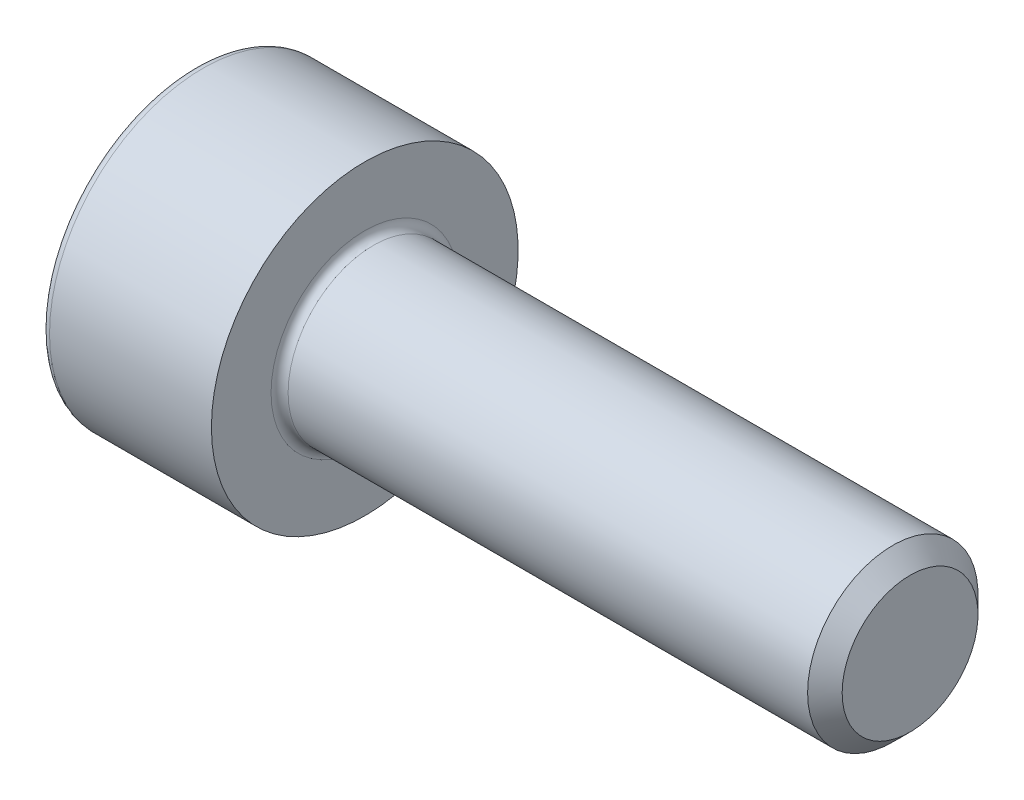
ISO-10303-21;
HEADER;
FILE_DESCRIPTION(('STEP AP214'),'2;1');
FILE_NAME('part.step','',(''),(''),'','','');
FILE_SCHEMA(('AUTOMOTIVE_DESIGN { 1 0 10303 214 1 1 1 1 }'));
ENDSEC;
DATA;
#1=APPLICATION_CONTEXT('core data for automotive mechanical design processes');
#2=APPLICATION_PROTOCOL_DEFINITION('international standard','automotive_design',2000,#1);
#3=PRODUCT_CONTEXT('',#1,'mechanical');
#4=PRODUCT('Part','Part','',(#3));
#5=PRODUCT_RELATED_PRODUCT_CATEGORY('part','',(#4));
#6=PRODUCT_DEFINITION_FORMATION('','',#4);
#7=PRODUCT_DEFINITION_CONTEXT('part definition',#1,'design');
#8=PRODUCT_DEFINITION('design','',#6,#7);
#9=PRODUCT_DEFINITION_SHAPE('','',#8);
#10=(LENGTH_UNIT() NAMED_UNIT(*) SI_UNIT(.MILLI.,.METRE.));
#11=(NAMED_UNIT(*) PLANE_ANGLE_UNIT() SI_UNIT($,.RADIAN.));
#12=(NAMED_UNIT(*) SI_UNIT($,.STERADIAN.) SOLID_ANGLE_UNIT());
#13=UNCERTAINTY_MEASURE_WITH_UNIT(LENGTH_MEASURE(1.E-05),#10,'distance_accuracy_value','');
#14=(GEOMETRIC_REPRESENTATION_CONTEXT(3) GLOBAL_UNCERTAINTY_ASSIGNED_CONTEXT((#13)) GLOBAL_UNIT_ASSIGNED_CONTEXT((#10,
#11,#12)) REPRESENTATION_CONTEXT('',''));
#15=CARTESIAN_POINT('',(0.,0.,0.));
#16=DIRECTION('',(0.,0.,1.));
#17=DIRECTION('',(1.,0.,0.));
#18=AXIS2_PLACEMENT_3D('',#15,#16,#17);
#19=CARTESIAN_POINT('',(8.,0.,0.));
#20=DIRECTION('',(-1.,0.,0.));
#21=DIRECTION('',(0.,0.,1.));
#22=AXIS2_PLACEMENT_3D('',#19,#20,#21);
#23=CONICAL_SURFACE('',#22,0.996499999993503,0.785398163397448);
#24=CARTESIAN_POINT('',(7.7464999999935,0.,0.));
#25=DIRECTION('',(-1.,0.,0.));
#26=DIRECTION('',(0.,0.,1.));
#27=AXIS2_PLACEMENT_3D('',#24,#25,#26);
#28=CIRCLE('',#27,1.25);
#29=CARTESIAN_POINT('',(7.7464999999935,0.,1.25));
#30=VERTEX_POINT('',#29);
#31=EDGE_CURVE('E11',#30,#30,#28,.T.);
#32=ORIENTED_EDGE('',*,*,#31,.F.);
#33=EDGE_LOOP('',(#32));
#34=FACE_BOUND('',#33,.T.);
#35=CARTESIAN_POINT('',(8.,0.,0.));
#36=DIRECTION('',(-1.,0.,0.));
#37=DIRECTION('',(0.,0.,1.));
#38=AXIS2_PLACEMENT_3D('',#35,#36,#37);
#39=CIRCLE('',#38,0.996499999993503);
#40=CARTESIAN_POINT('',(8.,0.,0.996499999993503));
#41=VERTEX_POINT('',#40);
#42=EDGE_CURVE('E134',#41,#41,#39,.T.);
#43=ORIENTED_EDGE('',*,*,#42,.T.);
#44=EDGE_LOOP('',(#43));
#45=FACE_BOUND('',#44,.T.);
#46=ADVANCED_FACE('F33',(#34,#45),#23,.T.);
#47=CARTESIAN_POINT('',(-2.5,0.,0.));
#48=DIRECTION('',(-1.,0.,0.));
#49=DIRECTION('',(0.,0.,1.));
#50=AXIS2_PLACEMENT_3D('',#47,#48,#49);
#51=CYLINDRICAL_SURFACE('',#50,1.25);
#52=CARTESIAN_POINT('',(0.125,0.,0.));
#53=DIRECTION('',(-1.,0.,0.));
#54=DIRECTION('',(0.,0.,1.));
#55=AXIS2_PLACEMENT_3D('',#52,#53,#54);
#56=CIRCLE('',#55,1.25);
#57=CARTESIAN_POINT('',(0.125,0.,1.25));
#58=VERTEX_POINT('',#57);
#59=EDGE_CURVE('E40',#58,#58,#56,.T.);
#60=ORIENTED_EDGE('',*,*,#59,.F.);
#61=EDGE_LOOP('',(#60));
#62=FACE_BOUND('',#61,.T.);
#63=ORIENTED_EDGE('',*,*,#31,.T.);
#64=EDGE_LOOP('',(#63));
#65=FACE_BOUND('',#64,.T.);
#66=ADVANCED_FACE('F158',(#62,#65),#51,.T.);
#67=CARTESIAN_POINT('',(0.125,0.,0.));
#68=DIRECTION('',(-1.,0.,0.));
#69=DIRECTION('',(0.,0.,1.));
#70=AXIS2_PLACEMENT_3D('',#67,#68,#69);
#71=TOROIDAL_SURFACE('',#70,1.375,0.125);
#72=CARTESIAN_POINT('',(0.,0.,0.));
#73=DIRECTION('',(-1.,0.,0.));
#74=DIRECTION('',(0.,0.,1.));
#75=AXIS2_PLACEMENT_3D('',#72,#73,#74);
#76=CIRCLE('',#75,1.375);
#77=CARTESIAN_POINT('',(0.,0.,1.375));
#78=VERTEX_POINT('',#77);
#79=EDGE_CURVE('E151',#78,#78,#76,.T.);
#80=ORIENTED_EDGE('',*,*,#79,.F.);
#81=EDGE_LOOP('',(#80));
#82=FACE_BOUND('',#81,.T.);
#83=ORIENTED_EDGE('',*,*,#59,.T.);
#84=EDGE_LOOP('',(#83));
#85=FACE_BOUND('',#84,.T.);
#86=ADVANCED_FACE('F156',(#82,#85),#71,.F.);
#87=CARTESIAN_POINT('',(0.,1.375,0.));
#88=DIRECTION('',(-1.,0.,0.));
#89=DIRECTION('',(0.,0.,1.));
#90=AXIS2_PLACEMENT_3D('',#87,#88,#89);
#91=PLANE('',#90);
#92=CARTESIAN_POINT('',(0.,0.,0.));
#93=DIRECTION('',(-1.,0.,0.));
#94=DIRECTION('',(0.,0.,1.));
#95=AXIS2_PLACEMENT_3D('',#92,#93,#94);
#96=CIRCLE('',#95,2.25);
#97=CARTESIAN_POINT('',(0.,0.,2.25));
#98=VERTEX_POINT('',#97);
#99=EDGE_CURVE('E148',#98,#98,#96,.T.);
#100=ORIENTED_EDGE('',*,*,#99,.F.);
#101=EDGE_LOOP('',(#100));
#102=FACE_BOUND('',#101,.T.);
#103=ORIENTED_EDGE('',*,*,#79,.T.);
#104=EDGE_LOOP('',(#103));
#105=FACE_BOUND('',#104,.T.);
#106=ADVANCED_FACE('F189',(#102,#105),#91,.F.);
#107=CARTESIAN_POINT('',(-2.5,0.,0.));
#108=DIRECTION('',(-1.,0.,0.));
#109=DIRECTION('',(0.,0.,1.));
#110=AXIS2_PLACEMENT_3D('',#107,#108,#109);
#111=CYLINDRICAL_SURFACE('',#110,2.25);
#112=CARTESIAN_POINT('',(-2.375,0.,0.));
#113=DIRECTION('',(-1.,0.,0.));
#114=DIRECTION('',(0.,0.,1.));
#115=AXIS2_PLACEMENT_3D('',#112,#113,#114);
#116=CIRCLE('',#115,2.25);
#117=CARTESIAN_POINT('',(-2.375,0.,2.25));
#118=VERTEX_POINT('',#117);
#119=EDGE_CURVE('E145',#118,#118,#116,.T.);
#120=ORIENTED_EDGE('',*,*,#119,.F.);
#121=EDGE_LOOP('',(#120));
#122=FACE_BOUND('',#121,.T.);
#123=ORIENTED_EDGE('',*,*,#99,.T.);
#124=EDGE_LOOP('',(#123));
#125=FACE_BOUND('',#124,.T.);
#126=ADVANCED_FACE('F185',(#122,#125),#111,.T.);
#127=CARTESIAN_POINT('',(-2.375,0.,0.));
#128=DIRECTION('',(-1.,0.,0.));
#129=DIRECTION('',(0.,0.,1.));
#130=AXIS2_PLACEMENT_3D('',#127,#128,#129);
#131=TOROIDAL_SURFACE('',#130,2.125,0.125);
#132=CARTESIAN_POINT('',(-2.5,0.,0.));
#133=DIRECTION('',(-1.,0.,0.));
#134=DIRECTION('',(0.,0.,1.));
#135=AXIS2_PLACEMENT_3D('',#132,#133,#134);
#136=CIRCLE('',#135,2.125);
#137=CARTESIAN_POINT('',(-2.5,0.,2.125));
#138=VERTEX_POINT('',#137);
#139=EDGE_CURVE('E142',#138,#138,#136,.T.);
#140=ORIENTED_EDGE('',*,*,#139,.F.);
#141=EDGE_LOOP('',(#140));
#142=FACE_BOUND('',#141,.T.);
#143=ORIENTED_EDGE('',*,*,#119,.T.);
#144=EDGE_LOOP('',(#143));
#145=FACE_BOUND('',#144,.T.);
#146=ADVANCED_FACE('F178',(#142,#145),#131,.T.);
#147=CARTESIAN_POINT('',(-2.5,2.125,0.));
#148=DIRECTION('',(1.,0.,0.));
#149=DIRECTION('',(0.,0.,-1.));
#150=AXIS2_PLACEMENT_3D('',#147,#148,#149);
#151=PLANE('',#150);
#152=DIRECTION('',(0.,0.5,-0.866025403784438));
#153=VECTOR('',#152,1.);
#154=CARTESIAN_POINT('',(-2.5,0.591784025919366,1.025));
#155=LINE('',#154,#153);
#156=CARTESIAN_POINT('',(-2.5,0.591784025919366,1.025));
#157=VERTEX_POINT('',#156);
#158=CARTESIAN_POINT('',(-2.5,1.18356805183873,0.));
#159=VERTEX_POINT('',#158);
#160=EDGE_CURVE('E121',#157,#159,#155,.T.);
#161=ORIENTED_EDGE('',*,*,#160,.F.);
#162=DIRECTION('',(0.,1.,0.));
#163=VECTOR('',#162,1.);
#164=CARTESIAN_POINT('',(-2.5,-0.591784025919367,1.025));
#165=LINE('',#164,#163);
#166=CARTESIAN_POINT('',(-2.5,-0.591784025919367,1.025));
#167=VERTEX_POINT('',#166);
#168=EDGE_CURVE('E47',#167,#157,#165,.T.);
#169=ORIENTED_EDGE('',*,*,#168,.F.);
#170=DIRECTION('',(0.,0.5,0.866025403784439));
#171=VECTOR('',#170,1.);
#172=CARTESIAN_POINT('',(-2.5,-1.18356805183873,0.));
#173=LINE('',#172,#171);
#174=CARTESIAN_POINT('',(-2.5,-1.18356805183873,0.));
#175=VERTEX_POINT('',#174);
#176=EDGE_CURVE('E130',#175,#167,#173,.T.);
#177=ORIENTED_EDGE('',*,*,#176,.F.);
#178=DIRECTION('',(0.,-0.5,0.866025403784438));
#179=VECTOR('',#178,1.);
#180=CARTESIAN_POINT('',(-2.5,-0.591784025919366,-1.025));
#181=LINE('',#180,#179);
#182=CARTESIAN_POINT('',(-2.5,-0.591784025919366,-1.025));
#183=VERTEX_POINT('',#182);
#184=EDGE_CURVE('E128',#183,#175,#181,.T.);
#185=ORIENTED_EDGE('',*,*,#184,.F.);
#186=DIRECTION('',(0.,-1.,0.));
#187=VECTOR('',#186,1.);
#188=CARTESIAN_POINT('',(-2.5,0.591784025919367,-1.025));
#189=LINE('',#188,#187);
#190=CARTESIAN_POINT('',(-2.5,0.591784025919367,-1.025));
#191=VERTEX_POINT('',#190);
#192=EDGE_CURVE('E95',#191,#183,#189,.T.);
#193=ORIENTED_EDGE('',*,*,#192,.F.);
#194=DIRECTION('',(0.,-0.5,-0.866025403784439));
#195=VECTOR('',#194,1.);
#196=CARTESIAN_POINT('',(-2.5,1.18356805183873,0.));
#197=LINE('',#196,#195);
#198=EDGE_CURVE('E124',#159,#191,#197,.T.);
#199=ORIENTED_EDGE('',*,*,#198,.F.);
#200=EDGE_LOOP('',(#161,#169,#177,#185,#193,#199));
#201=FACE_BOUND('',#200,.T.);
#202=ORIENTED_EDGE('',*,*,#139,.T.);
#203=EDGE_LOOP('',(#202));
#204=FACE_BOUND('',#203,.T.);
#205=ADVANCED_FACE('F170',(#201,#204),#151,.F.);
#206=CARTESIAN_POINT('',(8.,0.996499999993503,0.));
#207=DIRECTION('',(-1.,0.,0.));
#208=DIRECTION('',(0.,0.,1.));
#209=AXIS2_PLACEMENT_3D('',#206,#207,#208);
#210=PLANE('',#209);
#211=ORIENTED_EDGE('',*,*,#42,.F.);
#212=EDGE_LOOP('',(#211));
#213=FACE_BOUND('',#212,.T.);
#214=ADVANCED_FACE('F167',(#213),#210,.F.);
#215=CARTESIAN_POINT('',(-1.4,-0.591784025919367,1.025));
#216=DIRECTION('',(0.,0.,1.));
#217=DIRECTION('',(1.,0.,0.));
#218=AXIS2_PLACEMENT_3D('',#215,#216,#217);
#219=PLANE('',#218);
#220=ORIENTED_EDGE('',*,*,#168,.T.);
#221=DIRECTION('',(-1.,0.,0.));
#222=VECTOR('',#221,1.);
#223=CARTESIAN_POINT('',(-1.4,0.591784025919366,1.025));
#224=LINE('',#223,#222);
#225=CARTESIAN_POINT('',(-1.4,0.591784025919366,1.025));
#226=VERTEX_POINT('',#225);
#227=EDGE_CURVE('E77',#226,#157,#224,.T.);
#228=ORIENTED_EDGE('',*,*,#227,.F.);
#229=DIRECTION('',(0.,1.,0.));
#230=VECTOR('',#229,1.);
#231=CARTESIAN_POINT('',(-1.4,-0.591784025919367,1.025));
#232=LINE('',#231,#230);
#233=CARTESIAN_POINT('',(-1.4,-0.591784025919367,1.025));
#234=VERTEX_POINT('',#233);
#235=EDGE_CURVE('E132',#234,#226,#232,.T.);
#236=ORIENTED_EDGE('',*,*,#235,.F.);
#237=DIRECTION('',(-1.,0.,0.));
#238=VECTOR('',#237,1.);
#239=CARTESIAN_POINT('',(-1.4,-0.591784025919367,1.025));
#240=LINE('',#239,#238);
#241=EDGE_CURVE('E55',#234,#167,#240,.T.);
#242=ORIENTED_EDGE('',*,*,#241,.T.);
#243=EDGE_LOOP('',(#220,#228,#236,#242));
#244=FACE_BOUND('',#243,.T.);
#245=ADVANCED_FACE('F169',(#244),#219,.F.);
#246=CARTESIAN_POINT('',(-1.4,-1.18356805183873,0.));
#247=DIRECTION('',(0.,-0.866025403784439,0.5));
#248=DIRECTION('',(0.,-0.5,-0.866025403784439));
#249=AXIS2_PLACEMENT_3D('',#246,#247,#248);
#250=PLANE('',#249);
#251=ORIENTED_EDGE('',*,*,#176,.T.);
#252=ORIENTED_EDGE('',*,*,#241,.F.);
#253=DIRECTION('',(0.,0.5,0.866025403784439));
#254=VECTOR('',#253,1.);
#255=CARTESIAN_POINT('',(-1.4,-1.18356805183873,0.));
#256=LINE('',#255,#254);
#257=CARTESIAN_POINT('',(-1.4,-1.18356805183873,0.));
#258=VERTEX_POINT('',#257);
#259=EDGE_CURVE('E107',#258,#234,#256,.T.);
#260=ORIENTED_EDGE('',*,*,#259,.F.);
#261=DIRECTION('',(-1.,0.,0.));
#262=VECTOR('',#261,1.);
#263=CARTESIAN_POINT('',(-1.4,-1.18356805183873,0.));
#264=LINE('',#263,#262);
#265=EDGE_CURVE('E99',#258,#175,#264,.T.);
#266=ORIENTED_EDGE('',*,*,#265,.T.);
#267=EDGE_LOOP('',(#251,#252,#260,#266));
#268=FACE_BOUND('',#267,.T.);
#269=ADVANCED_FACE('F176',(#268),#250,.F.);
#270=CARTESIAN_POINT('',(-1.4,-0.591784025919366,-1.025));
#271=DIRECTION('',(0.,-0.866025403784439,-0.5));
#272=DIRECTION('',(0.,0.5,-0.866025403784438));
#273=AXIS2_PLACEMENT_3D('',#270,#271,#272);
#274=PLANE('',#273);
#275=ORIENTED_EDGE('',*,*,#184,.T.);
#276=ORIENTED_EDGE('',*,*,#265,.F.);
#277=DIRECTION('',(0.,-0.5,0.866025403784438));
#278=VECTOR('',#277,1.);
#279=CARTESIAN_POINT('',(-1.4,-0.591784025919366,-1.025));
#280=LINE('',#279,#278);
#281=CARTESIAN_POINT('',(-1.4,-0.591784025919366,-1.025));
#282=VERTEX_POINT('',#281);
#283=EDGE_CURVE('E103',#282,#258,#280,.T.);
#284=ORIENTED_EDGE('',*,*,#283,.F.);
#285=DIRECTION('',(-1.,0.,0.));
#286=VECTOR('',#285,1.);
#287=CARTESIAN_POINT('',(-1.4,-0.591784025919366,-1.025));
#288=LINE('',#287,#286);
#289=EDGE_CURVE('E88',#282,#183,#288,.T.);
#290=ORIENTED_EDGE('',*,*,#289,.T.);
#291=EDGE_LOOP('',(#275,#276,#284,#290));
#292=FACE_BOUND('',#291,.T.);
#293=ADVANCED_FACE('F104',(#292),#274,.F.);
#294=CARTESIAN_POINT('',(-1.4,0.591784025919367,-1.025));
#295=DIRECTION('',(0.,0.,-1.));
#296=DIRECTION('',(-1.,0.,0.));
#297=AXIS2_PLACEMENT_3D('',#294,#295,#296);
#298=PLANE('',#297);
#299=ORIENTED_EDGE('',*,*,#192,.T.);
#300=ORIENTED_EDGE('',*,*,#289,.F.);
#301=DIRECTION('',(0.,-1.,0.));
#302=VECTOR('',#301,1.);
#303=CARTESIAN_POINT('',(-1.4,0.591784025919367,-1.025));
#304=LINE('',#303,#302);
#305=CARTESIAN_POINT('',(-1.4,0.591784025919367,-1.025));
#306=VERTEX_POINT('',#305);
#307=EDGE_CURVE('E92',#306,#282,#304,.T.);
#308=ORIENTED_EDGE('',*,*,#307,.F.);
#309=DIRECTION('',(-1.,0.,0.));
#310=VECTOR('',#309,1.);
#311=CARTESIAN_POINT('',(-1.4,0.591784025919367,-1.025));
#312=LINE('',#311,#310);
#313=EDGE_CURVE('E100',#306,#191,#312,.T.);
#314=ORIENTED_EDGE('',*,*,#313,.T.);
#315=EDGE_LOOP('',(#299,#300,#308,#314));
#316=FACE_BOUND('',#315,.T.);
#317=ADVANCED_FACE('F90',(#316),#298,.F.);
#318=CARTESIAN_POINT('',(-1.4,1.18356805183873,0.));
#319=DIRECTION('',(0.,0.866025403784439,-0.5));
#320=DIRECTION('',(0.,0.5,0.866025403784439));
#321=AXIS2_PLACEMENT_3D('',#318,#319,#320);
#322=PLANE('',#321);
#323=ORIENTED_EDGE('',*,*,#198,.T.);
#324=ORIENTED_EDGE('',*,*,#313,.F.);
#325=DIRECTION('',(0.,-0.5,-0.866025403784439));
#326=VECTOR('',#325,1.);
#327=CARTESIAN_POINT('',(-1.4,1.18356805183873,0.));
#328=LINE('',#327,#326);
#329=CARTESIAN_POINT('',(-1.4,1.18356805183873,0.));
#330=VERTEX_POINT('',#329);
#331=EDGE_CURVE('E113',#330,#306,#328,.T.);
#332=ORIENTED_EDGE('',*,*,#331,.F.);
#333=DIRECTION('',(-1.,0.,0.));
#334=VECTOR('',#333,1.);
#335=CARTESIAN_POINT('',(-1.4,1.18356805183873,0.));
#336=LINE('',#335,#334);
#337=EDGE_CURVE('E137',#330,#159,#336,.T.);
#338=ORIENTED_EDGE('',*,*,#337,.T.);
#339=EDGE_LOOP('',(#323,#324,#332,#338));
#340=FACE_BOUND('',#339,.T.);
#341=ADVANCED_FACE('F251',(#340),#322,.F.);
#342=CARTESIAN_POINT('',(-1.4,0.591784025919366,1.025));
#343=DIRECTION('',(0.,0.866025403784439,0.5));
#344=DIRECTION('',(0.,-0.5,0.866025403784438));
#345=AXIS2_PLACEMENT_3D('',#342,#343,#344);
#346=PLANE('',#345);
#347=ORIENTED_EDGE('',*,*,#160,.T.);
#348=ORIENTED_EDGE('',*,*,#337,.F.);
#349=DIRECTION('',(0.,0.5,-0.866025403784438));
#350=VECTOR('',#349,1.);
#351=CARTESIAN_POINT('',(-1.4,0.591784025919366,1.025));
#352=LINE('',#351,#350);
#353=EDGE_CURVE('E115',#226,#330,#352,.T.);
#354=ORIENTED_EDGE('',*,*,#353,.F.);
#355=ORIENTED_EDGE('',*,*,#227,.T.);
#356=EDGE_LOOP('',(#347,#348,#354,#355));
#357=FACE_BOUND('',#356,.T.);
#358=ADVANCED_FACE('F260',(#357),#346,.F.);
#359=CARTESIAN_POINT('',(-1.4,0.,0.));
#360=DIRECTION('',(-1.,0.,0.));
#361=DIRECTION('',(0.,0.,1.));
#362=AXIS2_PLACEMENT_3D('',#359,#360,#361);
#363=PLANE('',#362);
#364=ORIENTED_EDGE('',*,*,#235,.T.);
#365=ORIENTED_EDGE('',*,*,#353,.T.);
#366=ORIENTED_EDGE('',*,*,#331,.T.);
#367=ORIENTED_EDGE('',*,*,#307,.T.);
#368=ORIENTED_EDGE('',*,*,#283,.T.);
#369=ORIENTED_EDGE('',*,*,#259,.T.);
#370=EDGE_LOOP('',(#364,#365,#366,#367,#368,#369));
#371=FACE_BOUND('',#370,.T.);
#372=ADVANCED_FACE('F110',(#371),#363,.T.);
#373=CLOSED_SHELL('',(#46,#66,#86,#106,#126,#146,#205,#214,#245,#269,#293,#317,#341,#358,#372));
#374=MANIFOLD_SOLID_BREP('B2',#373);
#375=ADVANCED_BREP_SHAPE_REPRESENTATION('',(#18,#374),#14);
#376=SHAPE_DEFINITION_REPRESENTATION(#9,#375);
ENDSEC;
END-ISO-10303-21;
